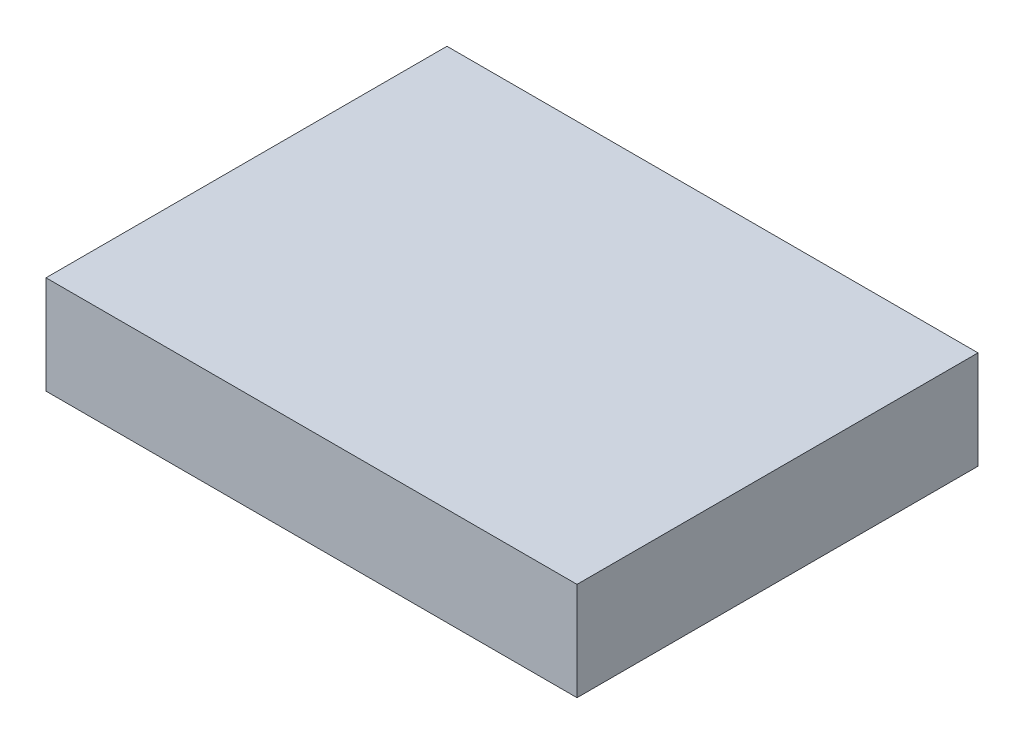
ISO-10303-21;
HEADER;
FILE_DESCRIPTION(('STEP AP214'),'2;1');
FILE_NAME('part.step','',(''),(''),'','','');
FILE_SCHEMA(('AUTOMOTIVE_DESIGN { 1 0 10303 214 1 1 1 1 }'));
ENDSEC;
DATA;
#1=APPLICATION_CONTEXT('core data for automotive mechanical design processes');
#2=APPLICATION_PROTOCOL_DEFINITION('international standard','automotive_design',2000,#1);
#3=PRODUCT_CONTEXT('',#1,'mechanical');
#4=PRODUCT('Part','Part','',(#3));
#5=PRODUCT_RELATED_PRODUCT_CATEGORY('part','',(#4));
#6=PRODUCT_DEFINITION_FORMATION('','',#4);
#7=PRODUCT_DEFINITION_CONTEXT('part definition',#1,'design');
#8=PRODUCT_DEFINITION('design','',#6,#7);
#9=PRODUCT_DEFINITION_SHAPE('','',#8);
#10=(LENGTH_UNIT() NAMED_UNIT(*) SI_UNIT(.MILLI.,.METRE.));
#11=(NAMED_UNIT(*) PLANE_ANGLE_UNIT() SI_UNIT($,.RADIAN.));
#12=(NAMED_UNIT(*) SI_UNIT($,.STERADIAN.) SOLID_ANGLE_UNIT());
#13=UNCERTAINTY_MEASURE_WITH_UNIT(LENGTH_MEASURE(1.E-05),#10,'distance_accuracy_value','');
#14=(GEOMETRIC_REPRESENTATION_CONTEXT(3) GLOBAL_UNCERTAINTY_ASSIGNED_CONTEXT((#13)) GLOBAL_UNIT_ASSIGNED_CONTEXT((#10,
#11,#12)) REPRESENTATION_CONTEXT('',''));
#15=CARTESIAN_POINT('',(0.,0.,0.));
#16=DIRECTION('',(0.,0.,1.));
#17=DIRECTION('',(1.,0.,0.));
#18=AXIS2_PLACEMENT_3D('',#15,#16,#17);
#19=CARTESIAN_POINT('',(0.,9.06,0.));
#20=DIRECTION('',(1.,0.,0.));
#21=DIRECTION('',(0.,0.,-1.));
#22=AXIS2_PLACEMENT_3D('',#19,#20,#21);
#23=PLANE('',#22);
#24=DIRECTION('',(0.,0.,1.));
#25=VECTOR('',#24,1.);
#26=CARTESIAN_POINT('',(0.,0.,0.));
#27=LINE('',#26,#25);
#28=CARTESIAN_POINT('',(0.,0.,-37.));
#29=VERTEX_POINT('',#28);
#30=CARTESIAN_POINT('',(0.,0.,0.));
#31=VERTEX_POINT('',#30);
#32=EDGE_CURVE('E95',#29,#31,#27,.T.);
#33=ORIENTED_EDGE('',*,*,#32,.T.);
#34=DIRECTION('',(0.,-1.,0.));
#35=VECTOR('',#34,1.);
#36=CARTESIAN_POINT('',(0.,9.06,0.));
#37=LINE('',#36,#35);
#38=CARTESIAN_POINT('',(0.,9.06,0.));
#39=VERTEX_POINT('',#38);
#40=EDGE_CURVE('E11',#39,#31,#37,.T.);
#41=ORIENTED_EDGE('',*,*,#40,.F.);
#42=DIRECTION('',(0.,0.,1.));
#43=VECTOR('',#42,1.);
#44=CARTESIAN_POINT('',(0.,9.06,0.));
#45=LINE('',#44,#43);
#46=CARTESIAN_POINT('',(0.,9.06,-37.));
#47=VERTEX_POINT('',#46);
#48=EDGE_CURVE('E83',#47,#39,#45,.T.);
#49=ORIENTED_EDGE('',*,*,#48,.F.);
#50=DIRECTION('',(0.,-1.,0.));
#51=VECTOR('',#50,1.);
#52=CARTESIAN_POINT('',(0.,9.06,-37.));
#53=LINE('',#52,#51);
#54=EDGE_CURVE('E91',#47,#29,#53,.T.);
#55=ORIENTED_EDGE('',*,*,#54,.T.);
#56=EDGE_LOOP('',(#33,#41,#49,#55));
#57=FACE_BOUND('',#56,.T.);
#58=ADVANCED_FACE('F32',(#57),#23,.F.);
#59=CARTESIAN_POINT('',(0.,9.06,0.));
#60=DIRECTION('',(0.,0.,-1.));
#61=DIRECTION('',(-1.,0.,0.));
#62=AXIS2_PLACEMENT_3D('',#59,#60,#61);
#63=PLANE('',#62);
#64=DIRECTION('',(1.,0.,0.));
#65=VECTOR('',#64,1.);
#66=CARTESIAN_POINT('',(0.,0.,0.));
#67=LINE('',#66,#65);
#68=CARTESIAN_POINT('',(49.,0.,0.));
#69=VERTEX_POINT('',#68);
#70=EDGE_CURVE('E87',#31,#69,#67,.T.);
#71=ORIENTED_EDGE('',*,*,#70,.T.);
#72=DIRECTION('',(0.,-1.,0.));
#73=VECTOR('',#72,1.);
#74=CARTESIAN_POINT('',(49.,9.06,0.));
#75=LINE('',#74,#73);
#76=CARTESIAN_POINT('',(49.,9.06,0.));
#77=VERTEX_POINT('',#76);
#78=EDGE_CURVE('E40',#77,#69,#75,.T.);
#79=ORIENTED_EDGE('',*,*,#78,.F.);
#80=DIRECTION('',(1.,0.,0.));
#81=VECTOR('',#80,1.);
#82=CARTESIAN_POINT('',(0.,9.06,0.));
#83=LINE('',#82,#81);
#84=EDGE_CURVE('E78',#39,#77,#83,.T.);
#85=ORIENTED_EDGE('',*,*,#84,.F.);
#86=ORIENTED_EDGE('',*,*,#40,.T.);
#87=EDGE_LOOP('',(#71,#79,#85,#86));
#88=FACE_BOUND('',#87,.T.);
#89=ADVANCED_FACE('F86',(#88),#63,.F.);
#90=CARTESIAN_POINT('',(49.,9.06,0.));
#91=DIRECTION('',(-1.,0.,0.));
#92=DIRECTION('',(0.,0.,1.));
#93=AXIS2_PLACEMENT_3D('',#90,#91,#92);
#94=PLANE('',#93);
#95=DIRECTION('',(0.,0.,-1.));
#96=VECTOR('',#95,1.);
#97=CARTESIAN_POINT('',(49.,0.,0.));
#98=LINE('',#97,#96);
#99=CARTESIAN_POINT('',(49.,0.,-37.));
#100=VERTEX_POINT('',#99);
#101=EDGE_CURVE('E65',#69,#100,#98,.T.);
#102=ORIENTED_EDGE('',*,*,#101,.T.);
#103=DIRECTION('',(0.,-1.,0.));
#104=VECTOR('',#103,1.);
#105=CARTESIAN_POINT('',(49.,9.06,-37.));
#106=LINE('',#105,#104);
#107=CARTESIAN_POINT('',(49.,9.06,-37.));
#108=VERTEX_POINT('',#107);
#109=EDGE_CURVE('E88',#108,#100,#106,.T.);
#110=ORIENTED_EDGE('',*,*,#109,.F.);
#111=DIRECTION('',(0.,0.,-1.));
#112=VECTOR('',#111,1.);
#113=CARTESIAN_POINT('',(49.,9.06,0.));
#114=LINE('',#113,#112);
#115=EDGE_CURVE('E81',#77,#108,#114,.T.);
#116=ORIENTED_EDGE('',*,*,#115,.F.);
#117=ORIENTED_EDGE('',*,*,#78,.T.);
#118=EDGE_LOOP('',(#102,#110,#116,#117));
#119=FACE_BOUND('',#118,.T.);
#120=ADVANCED_FACE('F89',(#119),#94,.F.);
#121=CARTESIAN_POINT('',(0.,9.06,-37.));
#122=DIRECTION('',(0.,0.,1.));
#123=DIRECTION('',(1.,0.,0.));
#124=AXIS2_PLACEMENT_3D('',#121,#122,#123);
#125=PLANE('',#124);
#126=DIRECTION('',(-1.,0.,0.));
#127=VECTOR('',#126,1.);
#128=CARTESIAN_POINT('',(0.,0.,-37.));
#129=LINE('',#128,#127);
#130=EDGE_CURVE('E71',#100,#29,#129,.T.);
#131=ORIENTED_EDGE('',*,*,#130,.T.);
#132=ORIENTED_EDGE('',*,*,#54,.F.);
#133=DIRECTION('',(-1.,0.,0.));
#134=VECTOR('',#133,1.);
#135=CARTESIAN_POINT('',(0.,9.06,-37.));
#136=LINE('',#135,#134);
#137=EDGE_CURVE('E48',#108,#47,#136,.T.);
#138=ORIENTED_EDGE('',*,*,#137,.F.);
#139=ORIENTED_EDGE('',*,*,#109,.T.);
#140=EDGE_LOOP('',(#131,#132,#138,#139));
#141=FACE_BOUND('',#140,.T.);
#142=ADVANCED_FACE('F102',(#141),#125,.F.);
#143=CARTESIAN_POINT('',(0.,9.06,0.));
#144=DIRECTION('',(0.,-1.,0.));
#145=DIRECTION('',(0.,0.,-1.));
#146=AXIS2_PLACEMENT_3D('',#143,#144,#145);
#147=PLANE('',#146);
#148=ORIENTED_EDGE('',*,*,#48,.T.);
#149=ORIENTED_EDGE('',*,*,#84,.T.);
#150=ORIENTED_EDGE('',*,*,#115,.T.);
#151=ORIENTED_EDGE('',*,*,#137,.T.);
#152=EDGE_LOOP('',(#148,#149,#150,#151));
#153=FACE_BOUND('',#152,.T.);
#154=ADVANCED_FACE('F79',(#153),#147,.F.);
#155=CARTESIAN_POINT('',(0.,0.,0.));
#156=DIRECTION('',(0.,-1.,0.));
#157=DIRECTION('',(0.,0.,-1.));
#158=AXIS2_PLACEMENT_3D('',#155,#156,#157);
#159=PLANE('',#158);
#160=ORIENTED_EDGE('',*,*,#32,.F.);
#161=ORIENTED_EDGE('',*,*,#130,.F.);
#162=ORIENTED_EDGE('',*,*,#101,.F.);
#163=ORIENTED_EDGE('',*,*,#70,.F.);
#164=EDGE_LOOP('',(#160,#161,#162,#163));
#165=FACE_BOUND('',#164,.T.);
#166=ADVANCED_FACE('F105',(#165),#159,.T.);
#167=CLOSED_SHELL('',(#58,#89,#120,#142,#154,#166));
#168=MANIFOLD_SOLID_BREP('B2',#167);
#169=ADVANCED_BREP_SHAPE_REPRESENTATION('',(#18,#168),#14);
#170=SHAPE_DEFINITION_REPRESENTATION(#9,#169);
ENDSEC;
END-ISO-10303-21;
